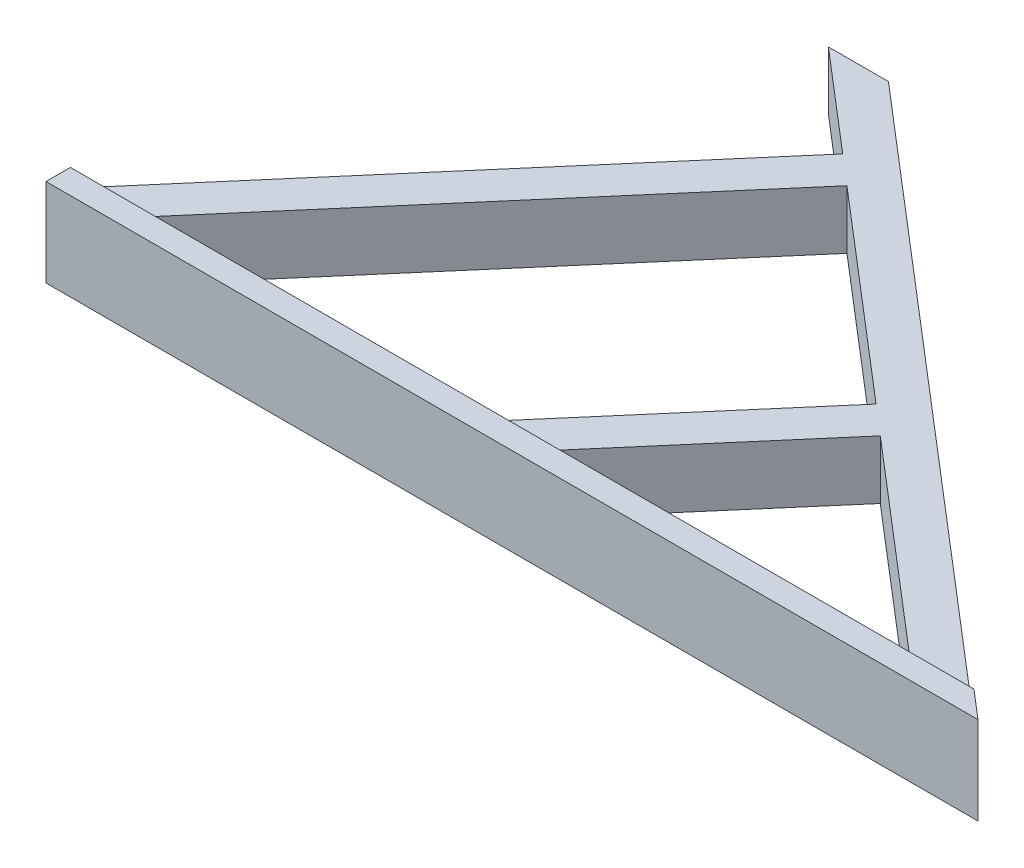
ISO-10303-21;
HEADER;
FILE_DESCRIPTION(('STEP AP214'),'2;1');
FILE_NAME('part.step','',(''),(''),'','','');
FILE_SCHEMA(('AUTOMOTIVE_DESIGN { 1 0 10303 214 1 1 1 1 }'));
ENDSEC;
DATA;
#1=APPLICATION_CONTEXT('core data for automotive mechanical design processes');
#2=APPLICATION_PROTOCOL_DEFINITION('international standard','automotive_design',2000,#1);
#3=PRODUCT_CONTEXT('',#1,'mechanical');
#4=PRODUCT('Part','Part','',(#3));
#5=PRODUCT_RELATED_PRODUCT_CATEGORY('part','',(#4));
#6=PRODUCT_DEFINITION_FORMATION('','',#4);
#7=PRODUCT_DEFINITION_CONTEXT('part definition',#1,'design');
#8=PRODUCT_DEFINITION('design','',#6,#7);
#9=PRODUCT_DEFINITION_SHAPE('','',#8);
#10=(LENGTH_UNIT() NAMED_UNIT(*) SI_UNIT(.MILLI.,.METRE.));
#11=(NAMED_UNIT(*) PLANE_ANGLE_UNIT() SI_UNIT($,.RADIAN.));
#12=(NAMED_UNIT(*) SI_UNIT($,.STERADIAN.) SOLID_ANGLE_UNIT());
#13=UNCERTAINTY_MEASURE_WITH_UNIT(LENGTH_MEASURE(1.E-05),#10,'distance_accuracy_value','');
#14=(GEOMETRIC_REPRESENTATION_CONTEXT(3) GLOBAL_UNCERTAINTY_ASSIGNED_CONTEXT((#13)) GLOBAL_UNIT_ASSIGNED_CONTEXT((#10,
#11,#12)) REPRESENTATION_CONTEXT('',''));
#15=CARTESIAN_POINT('',(0.,0.,0.));
#16=DIRECTION('',(0.,0.,1.));
#17=DIRECTION('',(1.,0.,0.));
#18=AXIS2_PLACEMENT_3D('',#15,#16,#17);
#19=CARTESIAN_POINT('',(0.,6.,0.));
#20=DIRECTION('',(0.,1.,0.));
#21=DIRECTION('',(0.,0.,1.));
#22=AXIS2_PLACEMENT_3D('',#19,#20,#21);
#23=PLANE('',#22);
#24=DIRECTION('',(-1.,0.,0.));
#25=VECTOR('',#24,1.);
#26=CARTESIAN_POINT('',(-28.729177989304,6.,2.50000000000001));
#27=LINE('',#26,#25);
#28=CARTESIAN_POINT('',(63.7971071274172,6.,2.50000000000001));
#29=VERTEX_POINT('',#28);
#30=CARTESIAN_POINT('',(-28.729177989304,6.,2.50000000000001));
#31=VERTEX_POINT('',#30);
#32=EDGE_CURVE('E52',#29,#31,#27,.T.);
#33=ORIENTED_EDGE('',*,*,#32,.F.);
#34=DIRECTION('',(-0.759271307334884,0.,-0.650774217265847));
#35=VECTOR('',#34,1.);
#36=CARTESIAN_POINT('',(2.54430611364013,6.,-50.));
#37=LINE('',#36,#35);
#38=CARTESIAN_POINT('',(2.54430611364013,6.,-50.));
#39=VERTEX_POINT('',#38);
#40=EDGE_CURVE('E241',#29,#39,#37,.T.);
#41=ORIENTED_EDGE('',*,*,#40,.T.);
#42=DIRECTION('',(-1.,0.,0.));
#43=VECTOR('',#42,1.);
#44=CARTESIAN_POINT('',(-3.60221889284452,6.,-50.));
#45=LINE('',#44,#43);
#46=CARTESIAN_POINT('',(-3.60221889284452,6.,-50.));
#47=VERTEX_POINT('',#46);
#48=EDGE_CURVE('E243',#39,#47,#45,.T.);
#49=ORIENTED_EDGE('',*,*,#48,.T.);
#50=DIRECTION('',(0.759271307334884,0.,0.650774217265847));
#51=VECTOR('',#50,1.);
#52=CARTESIAN_POINT('',(6.61797666976604,6.,-41.2402329663851));
#53=LINE('',#52,#51);
#54=CARTESIAN_POINT('',(6.61797666976604,6.,-41.2402329663851));
#55=VERTEX_POINT('',#54);
#56=EDGE_CURVE('E233',#47,#55,#53,.T.);
#57=ORIENTED_EDGE('',*,*,#56,.T.);
#58=DIRECTION('',(-0.650774217265846,0.,0.759271307334885));
#59=VECTOR('',#58,1.);
#60=CARTESIAN_POINT('',(6.61797666976604,6.,-41.2402329663851));
#61=LINE('',#60,#59);
#62=CARTESIAN_POINT('',(-28.729177989304,6.,0.));
#63=VERTEX_POINT('',#62);
#64=EDGE_CURVE('E236',#55,#63,#61,.T.);
#65=ORIENTED_EDGE('',*,*,#64,.T.);
#66=DIRECTION('',(0.,0.,1.));
#67=VECTOR('',#66,1.);
#68=CARTESIAN_POINT('',(-28.729177989304,6.,5.00000000000001));
#69=LINE('',#68,#67);
#70=EDGE_CURVE('E239',#63,#31,#69,.T.);
#71=ORIENTED_EDGE('',*,*,#70,.T.);
#72=EDGE_LOOP('',(#33,#41,#49,#57,#65,#71));
#73=FACE_BOUND('',#72,.T.);
#74=DIRECTION('',(-0.759271307334885,0.,-0.650774217265846));
#75=VECTOR('',#74,1.);
#76=CARTESIAN_POINT('',(54.7337820726575,6.,0.));
#77=LINE('',#76,#75);
#78=CARTESIAN_POINT('',(54.7337820726575,6.,0.));
#79=VERTEX_POINT('',#78);
#80=CARTESIAN_POINT('',(33.5453700004254,6.,-18.1606655594735));
#81=VERTEX_POINT('',#80);
#82=EDGE_CURVE('E211',#79,#81,#77,.T.);
#83=ORIENTED_EDGE('',*,*,#82,.F.);
#84=DIRECTION('',(1.,0.,0.));
#85=VECTOR('',#84,1.);
#86=CARTESIAN_POINT('',(17.979797061844,6.,0.));
#87=LINE('',#86,#85);
#88=CARTESIAN_POINT('',(17.979797061844,6.,0.));
#89=VERTEX_POINT('',#88);
#90=EDGE_CURVE('E209',#89,#79,#87,.T.);
#91=ORIENTED_EDGE('',*,*,#90,.F.);
#92=DIRECTION('',(-0.650774217265847,0.,0.759271307334885));
#93=VECTOR('',#92,1.);
#94=CARTESIAN_POINT('',(33.5453700004254,6.,-18.1606655594735));
#95=LINE('',#94,#93);
#96=EDGE_CURVE('E215',#81,#89,#95,.T.);
#97=ORIENTED_EDGE('',*,*,#96,.F.);
#98=EDGE_LOOP('',(#83,#91,#97));
#99=FACE_BOUND('',#98,.T.);
#100=DIRECTION('',(-0.650774217265847,0.,0.759271307334884));
#101=VECTOR('',#100,1.);
#102=CARTESIAN_POINT('',(9.65506189910558,6.,-38.6371360973218));
#103=LINE('',#102,#101);
#104=CARTESIAN_POINT('',(9.65506189910558,6.,-38.6371360973218));
#105=VERTEX_POINT('',#104);
#106=CARTESIAN_POINT('',(-23.4609689033576,6.,0.));
#107=VERTEX_POINT('',#106);
#108=EDGE_CURVE('E182',#105,#107,#103,.T.);
#109=ORIENTED_EDGE('',*,*,#108,.F.);
#110=DIRECTION('',(-0.759271307334885,0.,-0.650774217265846));
#111=VECTOR('',#110,1.);
#112=CARTESIAN_POINT('',(30.5082847710859,6.,-20.7637624285369));
#113=LINE('',#112,#111);
#114=CARTESIAN_POINT('',(30.5082847710859,6.,-20.7637624285369));
#115=VERTEX_POINT('',#114);
#116=EDGE_CURVE('E180',#115,#105,#113,.T.);
#117=ORIENTED_EDGE('',*,*,#116,.F.);
#118=DIRECTION('',(0.650774217265847,0.,-0.759271307334884));
#119=VECTOR('',#118,1.);
#120=CARTESIAN_POINT('',(30.5082847710859,6.,-20.7637624285369));
#121=LINE('',#120,#119);
#122=CARTESIAN_POINT('',(12.7115879758977,6.,0.));
#123=VERTEX_POINT('',#122);
#124=EDGE_CURVE('E187',#123,#115,#121,.T.);
#125=ORIENTED_EDGE('',*,*,#124,.F.);
#126=DIRECTION('',(1.,0.,0.));
#127=VECTOR('',#126,1.);
#128=CARTESIAN_POINT('',(-23.4609689033576,6.,0.));
#129=LINE('',#128,#127);
#130=EDGE_CURVE('E185',#107,#123,#129,.T.);
#131=ORIENTED_EDGE('',*,*,#130,.F.);
#132=EDGE_LOOP('',(#109,#117,#125,#131));
#133=FACE_BOUND('',#132,.T.);
#134=ADVANCED_FACE('F37',(#73,#99,#133),#23,.T.);
#135=CARTESIAN_POINT('',(0.,0.,0.));
#136=DIRECTION('',(0.,1.,0.));
#137=DIRECTION('',(0.,0.,1.));
#138=AXIS2_PLACEMENT_3D('',#135,#136,#137);
#139=PLANE('',#138);
#140=DIRECTION('',(1.,0.,0.));
#141=VECTOR('',#140,1.);
#142=CARTESIAN_POINT('',(17.979797061844,0.,0.));
#143=LINE('',#142,#141);
#144=CARTESIAN_POINT('',(17.979797061844,0.,0.));
#145=VERTEX_POINT('',#144);
#146=CARTESIAN_POINT('',(54.7337820726575,0.,0.));
#147=VERTEX_POINT('',#146);
#148=EDGE_CURVE('E208',#145,#147,#143,.T.);
#149=ORIENTED_EDGE('',*,*,#148,.T.);
#150=DIRECTION('',(-0.759271307334885,0.,-0.650774217265846));
#151=VECTOR('',#150,1.);
#152=CARTESIAN_POINT('',(54.7337820726575,0.,0.));
#153=LINE('',#152,#151);
#154=CARTESIAN_POINT('',(33.5453700004254,0.,-18.1606655594735));
#155=VERTEX_POINT('',#154);
#156=EDGE_CURVE('E220',#147,#155,#153,.T.);
#157=ORIENTED_EDGE('',*,*,#156,.T.);
#158=DIRECTION('',(-0.650774217265847,0.,0.759271307334885));
#159=VECTOR('',#158,1.);
#160=CARTESIAN_POINT('',(33.5453700004254,0.,-18.1606655594735));
#161=LINE('',#160,#159);
#162=EDGE_CURVE('E212',#155,#145,#161,.T.);
#163=ORIENTED_EDGE('',*,*,#162,.T.);
#164=EDGE_LOOP('',(#149,#157,#163));
#165=FACE_BOUND('',#164,.T.);
#166=DIRECTION('',(0.759271307334884,0.,0.650774217265847));
#167=VECTOR('',#166,1.);
#168=CARTESIAN_POINT('',(6.61797666976604,0.,-41.2402329663851));
#169=LINE('',#168,#167);
#170=CARTESIAN_POINT('',(-3.60221889284452,0.,-50.));
#171=VERTEX_POINT('',#170);
#172=CARTESIAN_POINT('',(6.61797666976604,0.,-41.2402329663851));
#173=VERTEX_POINT('',#172);
#174=EDGE_CURVE('E232',#171,#173,#169,.T.);
#175=ORIENTED_EDGE('',*,*,#174,.F.);
#176=DIRECTION('',(-1.,0.,0.));
#177=VECTOR('',#176,1.);
#178=CARTESIAN_POINT('',(-3.60221889284452,0.,-50.));
#179=LINE('',#178,#177);
#180=CARTESIAN_POINT('',(2.54430611364013,0.,-50.));
#181=VERTEX_POINT('',#180);
#182=EDGE_CURVE('E237',#181,#171,#179,.T.);
#183=ORIENTED_EDGE('',*,*,#182,.F.);
#184=DIRECTION('',(-0.759271307334884,0.,-0.650774217265847));
#185=VECTOR('',#184,1.);
#186=CARTESIAN_POINT('',(2.54430611364013,0.,-50.));
#187=LINE('',#186,#185);
#188=CARTESIAN_POINT('',(66.7139071756923,0.,5.));
#189=VERTEX_POINT('',#188);
#190=EDGE_CURVE('E253',#189,#181,#187,.T.);
#191=ORIENTED_EDGE('',*,*,#190,.F.);
#192=DIRECTION('',(1.,0.,0.));
#193=VECTOR('',#192,1.);
#194=CARTESIAN_POINT('',(66.7139071756923,0.,5.));
#195=LINE('',#194,#193);
#196=CARTESIAN_POINT('',(-28.729177989304,0.,5.00000000000001));
#197=VERTEX_POINT('',#196);
#198=EDGE_CURVE('E251',#197,#189,#195,.T.);
#199=ORIENTED_EDGE('',*,*,#198,.F.);
#200=DIRECTION('',(0.,0.,1.));
#201=VECTOR('',#200,1.);
#202=CARTESIAN_POINT('',(-28.729177989304,0.,5.00000000000001));
#203=LINE('',#202,#201);
#204=CARTESIAN_POINT('',(-28.729177989304,0.,0.));
#205=VERTEX_POINT('',#204);
#206=EDGE_CURVE('E152',#205,#197,#203,.T.);
#207=ORIENTED_EDGE('',*,*,#206,.F.);
#208=DIRECTION('',(-0.650774217265846,0.,0.759271307334885));
#209=VECTOR('',#208,1.);
#210=CARTESIAN_POINT('',(6.61797666976604,0.,-41.2402329663851));
#211=LINE('',#210,#209);
#212=EDGE_CURVE('E248',#173,#205,#211,.T.);
#213=ORIENTED_EDGE('',*,*,#212,.F.);
#214=EDGE_LOOP('',(#175,#183,#191,#199,#207,#213));
#215=FACE_BOUND('',#214,.T.);
#216=DIRECTION('',(-0.759271307334885,0.,-0.650774217265846));
#217=VECTOR('',#216,1.);
#218=CARTESIAN_POINT('',(30.5082847710859,0.,-20.7637624285369));
#219=LINE('',#218,#217);
#220=CARTESIAN_POINT('',(30.5082847710859,0.,-20.7637624285369));
#221=VERTEX_POINT('',#220);
#222=CARTESIAN_POINT('',(9.65506189910558,0.,-38.6371360973218));
#223=VERTEX_POINT('',#222);
#224=EDGE_CURVE('E179',#221,#223,#219,.T.);
#225=ORIENTED_EDGE('',*,*,#224,.T.);
#226=DIRECTION('',(-0.650774217265847,0.,0.759271307334884));
#227=VECTOR('',#226,1.);
#228=CARTESIAN_POINT('',(9.65506189910558,0.,-38.6371360973218));
#229=LINE('',#228,#227);
#230=CARTESIAN_POINT('',(-23.4609689033576,0.,0.));
#231=VERTEX_POINT('',#230);
#232=EDGE_CURVE('E192',#223,#231,#229,.T.);
#233=ORIENTED_EDGE('',*,*,#232,.T.);
#234=DIRECTION('',(1.,0.,0.));
#235=VECTOR('',#234,1.);
#236=CARTESIAN_POINT('',(-23.4609689033576,0.,0.));
#237=LINE('',#236,#235);
#238=CARTESIAN_POINT('',(12.7115879758977,0.,0.));
#239=VERTEX_POINT('',#238);
#240=EDGE_CURVE('E195',#231,#239,#237,.T.);
#241=ORIENTED_EDGE('',*,*,#240,.T.);
#242=DIRECTION('',(0.650774217265847,0.,-0.759271307334884));
#243=VECTOR('',#242,1.);
#244=CARTESIAN_POINT('',(30.5082847710859,0.,-20.7637624285369));
#245=LINE('',#244,#243);
#246=EDGE_CURVE('E183',#239,#221,#245,.T.);
#247=ORIENTED_EDGE('',*,*,#246,.T.);
#248=EDGE_LOOP('',(#225,#233,#241,#247));
#249=FACE_BOUND('',#248,.T.);
#250=ADVANCED_FACE('F266',(#165,#215,#249),#139,.F.);
#251=CARTESIAN_POINT('',(6.61797666976604,6.,-41.2402329663851));
#252=DIRECTION('',(0.650774217265847,0.,-0.759271307334884));
#253=DIRECTION('',(-0.759271307334884,0.,-0.650774217265847));
#254=AXIS2_PLACEMENT_3D('',#251,#252,#253);
#255=PLANE('',#254);
#256=ORIENTED_EDGE('',*,*,#174,.T.);
#257=DIRECTION('',(0.,-1.,0.));
#258=VECTOR('',#257,1.);
#259=CARTESIAN_POINT('',(6.61797666976604,6.,-41.2402329663851));
#260=LINE('',#259,#258);
#261=EDGE_CURVE('E11',#55,#173,#260,.T.);
#262=ORIENTED_EDGE('',*,*,#261,.F.);
#263=ORIENTED_EDGE('',*,*,#56,.F.);
#264=DIRECTION('',(0.,-1.,0.));
#265=VECTOR('',#264,1.);
#266=CARTESIAN_POINT('',(-3.60221889284452,6.,-50.));
#267=LINE('',#266,#265);
#268=EDGE_CURVE('E245',#47,#171,#267,.T.);
#269=ORIENTED_EDGE('',*,*,#268,.T.);
#270=EDGE_LOOP('',(#256,#262,#263,#269));
#271=FACE_BOUND('',#270,.T.);
#272=ADVANCED_FACE('F39',(#271),#255,.F.);
#273=CARTESIAN_POINT('',(6.61797666976604,6.,-41.2402329663851));
#274=DIRECTION('',(0.759271307334885,0.,0.650774217265847));
#275=DIRECTION('',(0.650774217265847,0.,-0.759271307334885));
#276=AXIS2_PLACEMENT_3D('',#273,#274,#275);
#277=PLANE('',#276);
#278=ORIENTED_EDGE('',*,*,#212,.T.);
#279=DIRECTION('',(0.,-1.,0.));
#280=VECTOR('',#279,1.);
#281=CARTESIAN_POINT('',(-28.729177989304,6.,0.));
#282=LINE('',#281,#280);
#283=EDGE_CURVE('E45',#63,#205,#282,.T.);
#284=ORIENTED_EDGE('',*,*,#283,.F.);
#285=ORIENTED_EDGE('',*,*,#64,.F.);
#286=ORIENTED_EDGE('',*,*,#261,.T.);
#287=EDGE_LOOP('',(#278,#284,#285,#286));
#288=FACE_BOUND('',#287,.T.);
#289=ADVANCED_FACE('F307',(#288),#277,.F.);
#290=CARTESIAN_POINT('',(-28.729177989304,6.,5.00000000000001));
#291=DIRECTION('',(1.,0.,0.));
#292=DIRECTION('',(0.,0.,-1.));
#293=AXIS2_PLACEMENT_3D('',#290,#291,#292);
#294=PLANE('',#293);
#295=ORIENTED_EDGE('',*,*,#206,.T.);
#296=DIRECTION('',(0.,-1.,0.));
#297=VECTOR('',#296,1.);
#298=CARTESIAN_POINT('',(-28.729177989304,6.,5.00000000000001));
#299=LINE('',#298,#297);
#300=CARTESIAN_POINT('',(-28.729177989304,9.,5.00000000000001));
#301=VERTEX_POINT('',#300);
#302=EDGE_CURVE('E144',#301,#197,#299,.T.);
#303=ORIENTED_EDGE('',*,*,#302,.F.);
#304=DIRECTION('',(0.,0.,1.));
#305=VECTOR('',#304,1.);
#306=CARTESIAN_POINT('',(-28.729177989304,9.,5.00000000000001));
#307=LINE('',#306,#305);
#308=CARTESIAN_POINT('',(-28.729177989304,9.,2.50000000000001));
#309=VERTEX_POINT('',#308);
#310=EDGE_CURVE('E149',#309,#301,#307,.T.);
#311=ORIENTED_EDGE('',*,*,#310,.F.);
#312=DIRECTION('',(0.,-1.,0.));
#313=VECTOR('',#312,1.);
#314=CARTESIAN_POINT('',(-28.729177989304,9.,2.50000000000001));
#315=LINE('',#314,#313);
#316=EDGE_CURVE('E173',#309,#31,#315,.T.);
#317=ORIENTED_EDGE('',*,*,#316,.T.);
#318=ORIENTED_EDGE('',*,*,#70,.F.);
#319=ORIENTED_EDGE('',*,*,#283,.T.);
#320=EDGE_LOOP('',(#295,#303,#311,#317,#318,#319));
#321=FACE_BOUND('',#320,.T.);
#322=ADVANCED_FACE('F146',(#321),#294,.F.);
#323=CARTESIAN_POINT('',(66.7139071756923,6.,5.));
#324=DIRECTION('',(0.,0.,-1.));
#325=DIRECTION('',(-1.,0.,0.));
#326=AXIS2_PLACEMENT_3D('',#323,#324,#325);
#327=PLANE('',#326);
#328=ORIENTED_EDGE('',*,*,#198,.T.);
#329=DIRECTION('',(0.,-1.,0.));
#330=VECTOR('',#329,1.);
#331=CARTESIAN_POINT('',(66.7139071756923,6.,5.));
#332=LINE('',#331,#330);
#333=CARTESIAN_POINT('',(66.7139071756923,9.,5.));
#334=VERTEX_POINT('',#333);
#335=EDGE_CURVE('E155',#334,#189,#332,.T.);
#336=ORIENTED_EDGE('',*,*,#335,.F.);
#337=DIRECTION('',(1.,0.,0.));
#338=VECTOR('',#337,1.);
#339=CARTESIAN_POINT('',(-28.729177989304,9.,5.00000000000001));
#340=LINE('',#339,#338);
#341=EDGE_CURVE('E158',#301,#334,#340,.T.);
#342=ORIENTED_EDGE('',*,*,#341,.F.);
#343=ORIENTED_EDGE('',*,*,#302,.T.);
#344=EDGE_LOOP('',(#328,#336,#342,#343));
#345=FACE_BOUND('',#344,.T.);
#346=ADVANCED_FACE('F159',(#345),#327,.F.);
#347=CARTESIAN_POINT('',(2.54430611364013,6.,-50.));
#348=DIRECTION('',(-0.650774217265847,0.,0.759271307334884));
#349=DIRECTION('',(0.759271307334885,0.,0.650774217265847));
#350=AXIS2_PLACEMENT_3D('',#347,#348,#349);
#351=PLANE('',#350);
#352=ORIENTED_EDGE('',*,*,#190,.T.);
#353=DIRECTION('',(0.,-1.,0.));
#354=VECTOR('',#353,1.);
#355=CARTESIAN_POINT('',(2.54430611364013,6.,-50.));
#356=LINE('',#355,#354);
#357=EDGE_CURVE('E258',#39,#181,#356,.T.);
#358=ORIENTED_EDGE('',*,*,#357,.F.);
#359=ORIENTED_EDGE('',*,*,#40,.F.);
#360=DIRECTION('',(0.,-1.,0.));
#361=VECTOR('',#360,1.);
#362=CARTESIAN_POINT('',(63.7971071274172,9.,2.50000000000001));
#363=LINE('',#362,#361);
#364=CARTESIAN_POINT('',(63.7971071274172,9.,2.50000000000001));
#365=VERTEX_POINT('',#364);
#366=EDGE_CURVE('E176',#365,#29,#363,.T.);
#367=ORIENTED_EDGE('',*,*,#366,.F.);
#368=DIRECTION('',(-0.759271307334885,0.,-0.650774217265846));
#369=VECTOR('',#368,1.);
#370=CARTESIAN_POINT('',(66.7139071756923,9.,5.));
#371=LINE('',#370,#369);
#372=EDGE_CURVE('E163',#334,#365,#371,.T.);
#373=ORIENTED_EDGE('',*,*,#372,.F.);
#374=ORIENTED_EDGE('',*,*,#335,.T.);
#375=EDGE_LOOP('',(#352,#358,#359,#367,#373,#374));
#376=FACE_BOUND('',#375,.T.);
#377=ADVANCED_FACE('F271',(#376),#351,.F.);
#378=CARTESIAN_POINT('',(-3.60221889284452,6.,-50.));
#379=DIRECTION('',(0.,0.,1.));
#380=DIRECTION('',(1.,0.,0.));
#381=AXIS2_PLACEMENT_3D('',#378,#379,#380);
#382=PLANE('',#381);
#383=ORIENTED_EDGE('',*,*,#182,.T.);
#384=ORIENTED_EDGE('',*,*,#268,.F.);
#385=ORIENTED_EDGE('',*,*,#48,.F.);
#386=ORIENTED_EDGE('',*,*,#357,.T.);
#387=EDGE_LOOP('',(#383,#384,#385,#386));
#388=FACE_BOUND('',#387,.T.);
#389=ADVANCED_FACE('F298',(#388),#382,.F.);
#390=CARTESIAN_POINT('',(17.979797061844,6.,0.));
#391=DIRECTION('',(0.,0.,-1.));
#392=DIRECTION('',(-1.,0.,0.));
#393=AXIS2_PLACEMENT_3D('',#390,#391,#392);
#394=PLANE('',#393);
#395=ORIENTED_EDGE('',*,*,#148,.F.);
#396=DIRECTION('',(0.,-1.,0.));
#397=VECTOR('',#396,1.);
#398=CARTESIAN_POINT('',(17.979797061844,6.,0.));
#399=LINE('',#398,#397);
#400=EDGE_CURVE('E217',#89,#145,#399,.T.);
#401=ORIENTED_EDGE('',*,*,#400,.F.);
#402=ORIENTED_EDGE('',*,*,#90,.T.);
#403=DIRECTION('',(0.,-1.,0.));
#404=VECTOR('',#403,1.);
#405=CARTESIAN_POINT('',(54.7337820726575,6.,0.));
#406=LINE('',#405,#404);
#407=EDGE_CURVE('E229',#79,#147,#406,.T.);
#408=ORIENTED_EDGE('',*,*,#407,.T.);
#409=EDGE_LOOP('',(#395,#401,#402,#408));
#410=FACE_BOUND('',#409,.T.);
#411=ADVANCED_FACE('F295',(#410),#394,.T.);
#412=CARTESIAN_POINT('',(54.7337820726575,6.,0.));
#413=DIRECTION('',(-0.650774217265846,0.,0.759271307334885));
#414=DIRECTION('',(0.759271307334885,0.,0.650774217265846));
#415=AXIS2_PLACEMENT_3D('',#412,#413,#414);
#416=PLANE('',#415);
#417=ORIENTED_EDGE('',*,*,#156,.F.);
#418=ORIENTED_EDGE('',*,*,#407,.F.);
#419=ORIENTED_EDGE('',*,*,#82,.T.);
#420=DIRECTION('',(0.,-1.,0.));
#421=VECTOR('',#420,1.);
#422=CARTESIAN_POINT('',(33.5453700004254,6.,-18.1606655594735));
#423=LINE('',#422,#421);
#424=EDGE_CURVE('E227',#81,#155,#423,.T.);
#425=ORIENTED_EDGE('',*,*,#424,.T.);
#426=EDGE_LOOP('',(#417,#418,#419,#425));
#427=FACE_BOUND('',#426,.T.);
#428=ADVANCED_FACE('F370',(#427),#416,.T.);
#429=CARTESIAN_POINT('',(33.5453700004254,6.,-18.1606655594735));
#430=DIRECTION('',(0.759271307334884,0.,0.650774217265847));
#431=DIRECTION('',(0.650774217265847,0.,-0.759271307334885));
#432=AXIS2_PLACEMENT_3D('',#429,#430,#431);
#433=PLANE('',#432);
#434=ORIENTED_EDGE('',*,*,#162,.F.);
#435=ORIENTED_EDGE('',*,*,#424,.F.);
#436=ORIENTED_EDGE('',*,*,#96,.T.);
#437=ORIENTED_EDGE('',*,*,#400,.T.);
#438=EDGE_LOOP('',(#434,#435,#436,#437));
#439=FACE_BOUND('',#438,.T.);
#440=ADVANCED_FACE('F378',(#439),#433,.T.);
#441=CARTESIAN_POINT('',(30.5082847710859,6.,-20.7637624285369));
#442=DIRECTION('',(-0.650774217265846,0.,0.759271307334885));
#443=DIRECTION('',(0.759271307334885,0.,0.650774217265846));
#444=AXIS2_PLACEMENT_3D('',#441,#442,#443);
#445=PLANE('',#444);
#446=ORIENTED_EDGE('',*,*,#224,.F.);
#447=DIRECTION('',(0.,-1.,0.));
#448=VECTOR('',#447,1.);
#449=CARTESIAN_POINT('',(30.5082847710859,6.,-20.7637624285369));
#450=LINE('',#449,#448);
#451=EDGE_CURVE('E189',#115,#221,#450,.T.);
#452=ORIENTED_EDGE('',*,*,#451,.F.);
#453=ORIENTED_EDGE('',*,*,#116,.T.);
#454=DIRECTION('',(0.,-1.,0.));
#455=VECTOR('',#454,1.);
#456=CARTESIAN_POINT('',(9.65506189910558,6.,-38.6371360973218));
#457=LINE('',#456,#455);
#458=EDGE_CURVE('E205',#105,#223,#457,.T.);
#459=ORIENTED_EDGE('',*,*,#458,.T.);
#460=EDGE_LOOP('',(#446,#452,#453,#459));
#461=FACE_BOUND('',#460,.T.);
#462=ADVANCED_FACE('F386',(#461),#445,.T.);
#463=CARTESIAN_POINT('',(9.65506189910558,6.,-38.6371360973218));
#464=DIRECTION('',(0.759271307334884,0.,0.650774217265847));
#465=DIRECTION('',(0.650774217265847,0.,-0.759271307334884));
#466=AXIS2_PLACEMENT_3D('',#463,#464,#465);
#467=PLANE('',#466);
#468=ORIENTED_EDGE('',*,*,#232,.F.);
#469=ORIENTED_EDGE('',*,*,#458,.F.);
#470=ORIENTED_EDGE('',*,*,#108,.T.);
#471=DIRECTION('',(0.,-1.,0.));
#472=VECTOR('',#471,1.);
#473=CARTESIAN_POINT('',(-23.4609689033576,6.,0.));
#474=LINE('',#473,#472);
#475=EDGE_CURVE('E203',#107,#231,#474,.T.);
#476=ORIENTED_EDGE('',*,*,#475,.T.);
#477=EDGE_LOOP('',(#468,#469,#470,#476));
#478=FACE_BOUND('',#477,.T.);
#479=ADVANCED_FACE('F395',(#478),#467,.T.);
#480=CARTESIAN_POINT('',(-23.4609689033576,6.,0.));
#481=DIRECTION('',(0.,0.,-1.));
#482=DIRECTION('',(-1.,0.,0.));
#483=AXIS2_PLACEMENT_3D('',#480,#481,#482);
#484=PLANE('',#483);
#485=ORIENTED_EDGE('',*,*,#240,.F.);
#486=ORIENTED_EDGE('',*,*,#475,.F.);
#487=ORIENTED_EDGE('',*,*,#130,.T.);
#488=DIRECTION('',(0.,-1.,0.));
#489=VECTOR('',#488,1.);
#490=CARTESIAN_POINT('',(12.7115879758977,6.,0.));
#491=LINE('',#490,#489);
#492=EDGE_CURVE('E60',#123,#239,#491,.T.);
#493=ORIENTED_EDGE('',*,*,#492,.T.);
#494=EDGE_LOOP('',(#485,#486,#487,#493));
#495=FACE_BOUND('',#494,.T.);
#496=ADVANCED_FACE('F284',(#495),#484,.T.);
#497=CARTESIAN_POINT('',(30.5082847710859,6.,-20.7637624285369));
#498=DIRECTION('',(-0.759271307334884,0.,-0.650774217265847));
#499=DIRECTION('',(-0.650774217265847,0.,0.759271307334884));
#500=AXIS2_PLACEMENT_3D('',#497,#498,#499);
#501=PLANE('',#500);
#502=ORIENTED_EDGE('',*,*,#246,.F.);
#503=ORIENTED_EDGE('',*,*,#492,.F.);
#504=ORIENTED_EDGE('',*,*,#124,.T.);
#505=ORIENTED_EDGE('',*,*,#451,.T.);
#506=EDGE_LOOP('',(#502,#503,#504,#505));
#507=FACE_BOUND('',#506,.T.);
#508=ADVANCED_FACE('F277',(#507),#501,.T.);
#509=CARTESIAN_POINT('',(-28.729177989304,9.,2.50000000000001));
#510=DIRECTION('',(0.,0.,1.));
#511=DIRECTION('',(1.,0.,0.));
#512=AXIS2_PLACEMENT_3D('',#509,#510,#511);
#513=PLANE('',#512);
#514=ORIENTED_EDGE('',*,*,#32,.T.);
#515=ORIENTED_EDGE('',*,*,#316,.F.);
#516=DIRECTION('',(-1.,0.,0.));
#517=VECTOR('',#516,1.);
#518=CARTESIAN_POINT('',(-28.729177989304,9.,2.50000000000001));
#519=LINE('',#518,#517);
#520=EDGE_CURVE('E167',#365,#309,#519,.T.);
#521=ORIENTED_EDGE('',*,*,#520,.F.);
#522=ORIENTED_EDGE('',*,*,#366,.T.);
#523=EDGE_LOOP('',(#514,#515,#521,#522));
#524=FACE_BOUND('',#523,.T.);
#525=ADVANCED_FACE('F275',(#524),#513,.F.);
#526=CARTESIAN_POINT('',(0.,9.,0.));
#527=DIRECTION('',(0.,-1.,0.));
#528=DIRECTION('',(0.,0.,-1.));
#529=AXIS2_PLACEMENT_3D('',#526,#527,#528);
#530=PLANE('',#529);
#531=ORIENTED_EDGE('',*,*,#310,.T.);
#532=ORIENTED_EDGE('',*,*,#341,.T.);
#533=ORIENTED_EDGE('',*,*,#372,.T.);
#534=ORIENTED_EDGE('',*,*,#520,.T.);
#535=EDGE_LOOP('',(#531,#532,#533,#534));
#536=FACE_BOUND('',#535,.T.);
#537=ADVANCED_FACE('F165',(#536),#530,.F.);
#538=CLOSED_SHELL('',(#134,#250,#272,#289,#322,#346,#377,#389,#411,#428,#440,#462,#479,#496,
#508,#525,#537));
#539=MANIFOLD_SOLID_BREP('B2',#538);
#540=ADVANCED_BREP_SHAPE_REPRESENTATION('',(#18,#539),#14);
#541=SHAPE_DEFINITION_REPRESENTATION(#9,#540);
ENDSEC;
END-ISO-10303-21;
